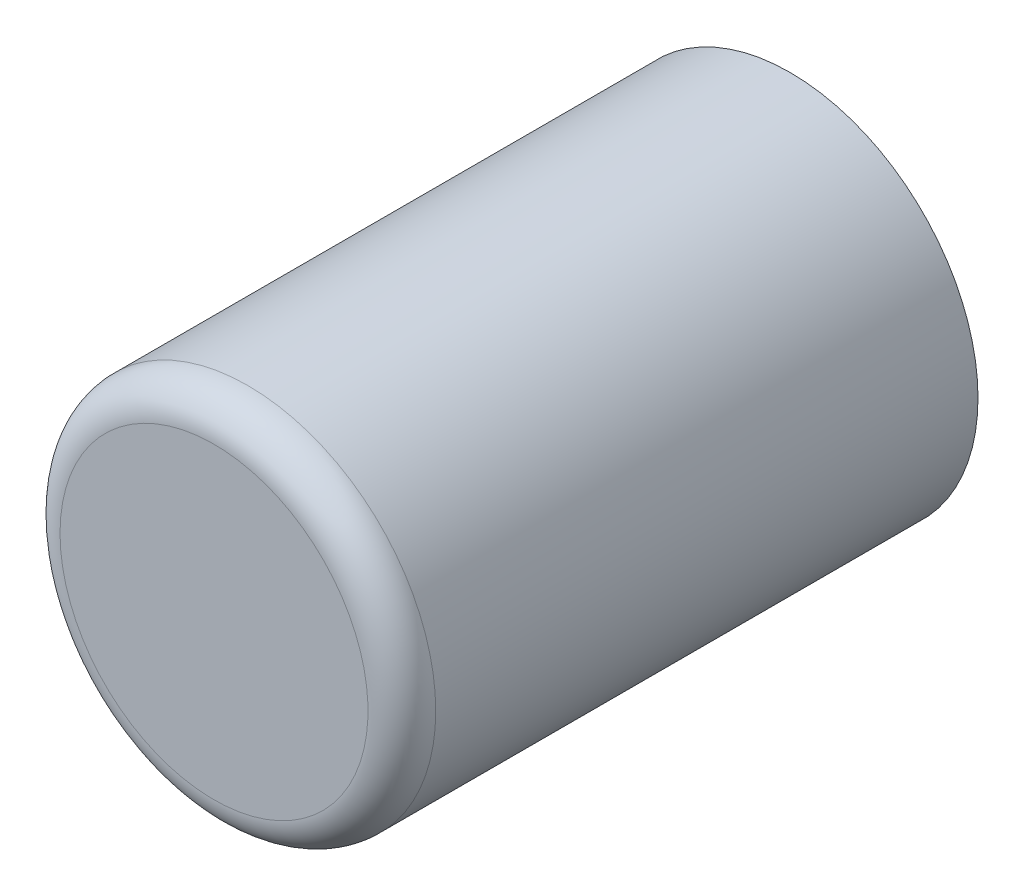
ISO-10303-21;
HEADER;
FILE_DESCRIPTION(('STEP AP214'),'2;1');
FILE_NAME('part.step','',(''),(''),'','','');
FILE_SCHEMA(('AUTOMOTIVE_DESIGN { 1 0 10303 214 1 1 1 1 }'));
ENDSEC;
DATA;
#1=APPLICATION_CONTEXT('core data for automotive mechanical design processes');
#2=APPLICATION_PROTOCOL_DEFINITION('international standard','automotive_design',2000,#1);
#3=PRODUCT_CONTEXT('',#1,'mechanical');
#4=PRODUCT('Part','Part','',(#3));
#5=PRODUCT_RELATED_PRODUCT_CATEGORY('part','',(#4));
#6=PRODUCT_DEFINITION_FORMATION('','',#4);
#7=PRODUCT_DEFINITION_CONTEXT('part definition',#1,'design');
#8=PRODUCT_DEFINITION('design','',#6,#7);
#9=PRODUCT_DEFINITION_SHAPE('','',#8);
#10=(LENGTH_UNIT() NAMED_UNIT(*) SI_UNIT(.MILLI.,.METRE.));
#11=(NAMED_UNIT(*) PLANE_ANGLE_UNIT() SI_UNIT($,.RADIAN.));
#12=(NAMED_UNIT(*) SI_UNIT($,.STERADIAN.) SOLID_ANGLE_UNIT());
#13=UNCERTAINTY_MEASURE_WITH_UNIT(LENGTH_MEASURE(1.E-05),#10,'distance_accuracy_value','');
#14=(GEOMETRIC_REPRESENTATION_CONTEXT(3) GLOBAL_UNCERTAINTY_ASSIGNED_CONTEXT((#13)) GLOBAL_UNIT_ASSIGNED_CONTEXT((#10,
#11,#12)) REPRESENTATION_CONTEXT('',''));
#15=CARTESIAN_POINT('',(0.,0.,0.));
#16=DIRECTION('',(0.,0.,1.));
#17=DIRECTION('',(1.,0.,0.));
#18=AXIS2_PLACEMENT_3D('',#15,#16,#17);
#19=CARTESIAN_POINT('',(-203.237767720353,-97.4477839792411,9.88000000000011));
#20=DIRECTION('',(0.,0.,1.));
#21=DIRECTION('',(1.,0.,0.));
#22=AXIS2_PLACEMENT_3D('',#19,#20,#21);
#23=PLANE('',#22);
#24=CARTESIAN_POINT('',(-205.237767720353,-97.4477839792411,9.88000000000012));
#25=DIRECTION('',(0.,0.,-1.));
#26=DIRECTION('',(-1.,0.,0.));
#27=AXIS2_PLACEMENT_3D('',#24,#25,#26);
#28=CIRCLE('',#27,4.00000000000003);
#29=CARTESIAN_POINT('',(-209.237767720353,-97.4477839792411,9.88000000000012));
#30=VERTEX_POINT('',#29);
#31=EDGE_CURVE('E19',#30,#30,#28,.T.);
#32=ORIENTED_EDGE('',*,*,#31,.F.);
#33=EDGE_LOOP('',(#32));
#34=FACE_BOUND('',#33,.T.);
#35=ADVANCED_FACE('F15',(#34),#23,.T.);
#36=CARTESIAN_POINT('',(-205.237767720353,-97.4477839792411,-5.08655862563023));
#37=DIRECTION('',(0.,0.,-1.));
#38=DIRECTION('',(-1.,0.,0.));
#39=AXIS2_PLACEMENT_3D('',#36,#37,#38);
#40=PLANE('',#39);
#41=CARTESIAN_POINT('',(-205.237767720353,-97.4477839792411,-5.08655862563072));
#42=DIRECTION('',(0.,0.,1.));
#43=DIRECTION('',(1.,0.,0.));
#44=AXIS2_PLACEMENT_3D('',#41,#42,#43);
#45=CIRCLE('',#44,4.88000000000002);
#46=CARTESIAN_POINT('',(-200.357767720353,-97.4477839792411,-5.08655862563072));
#47=VERTEX_POINT('',#46);
#48=EDGE_CURVE('E23',#47,#47,#45,.T.);
#49=ORIENTED_EDGE('',*,*,#48,.F.);
#50=EDGE_LOOP('',(#49));
#51=FACE_BOUND('',#50,.T.);
#52=ADVANCED_FACE('F35',(#51),#40,.T.);
#53=CARTESIAN_POINT('',(-205.237767720353,-97.4477839792411,9.00000000000014));
#54=DIRECTION('',(0.,0.,-1.));
#55=DIRECTION('',(-1.,0.,0.));
#56=AXIS2_PLACEMENT_3D('',#53,#54,#55);
#57=TOROIDAL_SURFACE('',#56,4.00000000000006,0.879999999999984);
#58=CARTESIAN_POINT('',(-205.237767720353,-97.4477839792411,9.00000000000011));
#59=DIRECTION('',(0.,0.,1.));
#60=DIRECTION('',(1.,0.,0.));
#61=AXIS2_PLACEMENT_3D('',#58,#59,#60);
#62=CIRCLE('',#61,4.88000000000002);
#63=CARTESIAN_POINT('',(-200.357767720353,-97.4477839792411,9.00000000000011));
#64=VERTEX_POINT('',#63);
#65=EDGE_CURVE('E10',#64,#64,#62,.F.);
#66=ORIENTED_EDGE('',*,*,#65,.F.);
#67=EDGE_LOOP('',(#66));
#68=FACE_BOUND('',#67,.T.);
#69=ORIENTED_EDGE('',*,*,#31,.T.);
#70=EDGE_LOOP('',(#69));
#71=FACE_BOUND('',#70,.T.);
#72=ADVANCED_FACE('F17',(#68,#71),#57,.T.);
#73=CARTESIAN_POINT('',(-205.237767720353,-97.4477839792411,1.93657000024695));
#74=DIRECTION('',(0.,0.,1.));
#75=DIRECTION('',(1.,0.,0.));
#76=AXIS2_PLACEMENT_3D('',#73,#74,#75);
#77=CYLINDRICAL_SURFACE('',#76,4.88000000000002);
#78=ORIENTED_EDGE('',*,*,#65,.T.);
#79=EDGE_LOOP('',(#78));
#80=FACE_BOUND('',#79,.T.);
#81=ORIENTED_EDGE('',*,*,#48,.T.);
#82=EDGE_LOOP('',(#81));
#83=FACE_BOUND('',#82,.T.);
#84=ADVANCED_FACE('F42',(#80,#83),#77,.T.);
#85=CLOSED_SHELL('',(#35,#52,#72,#84));
#86=MANIFOLD_SOLID_BREP('B1',#85);
#87=ADVANCED_BREP_SHAPE_REPRESENTATION('',(#18,#86),#14);
#88=SHAPE_DEFINITION_REPRESENTATION(#9,#87);
ENDSEC;
END-ISO-10303-21;
